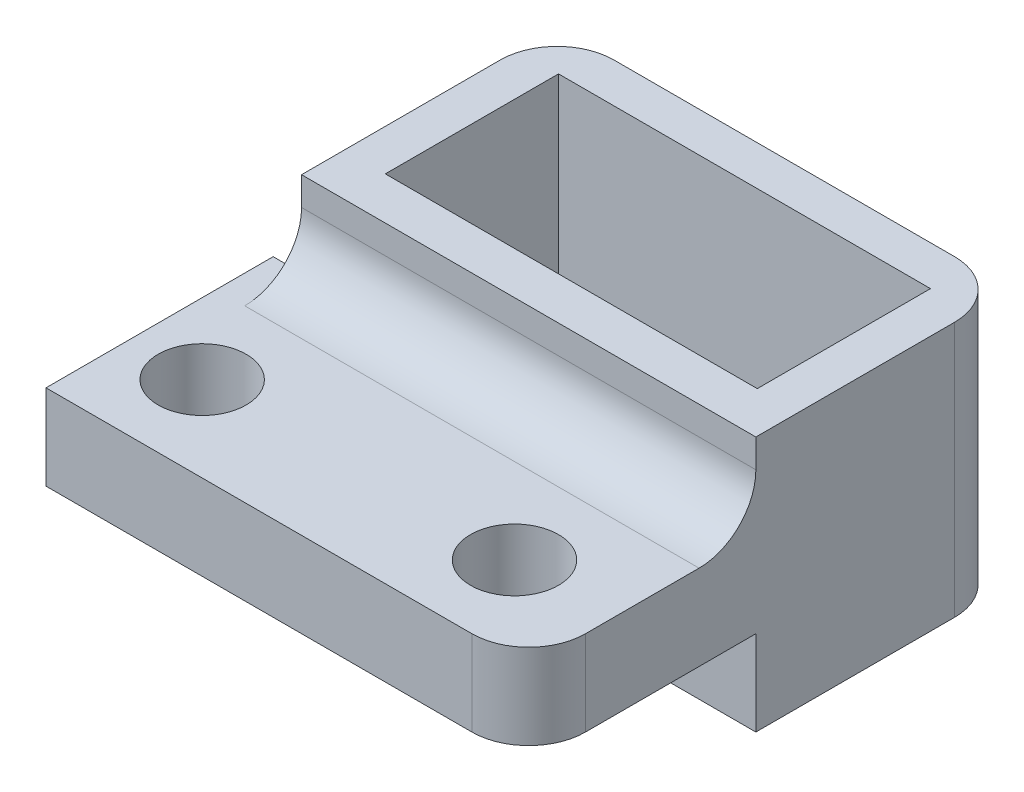
ISO-10303-21;
HEADER;
FILE_DESCRIPTION(('STEP AP214'),'2;1');
FILE_NAME('part.step','',(''),(''),'','','');
FILE_SCHEMA(('AUTOMOTIVE_DESIGN { 1 0 10303 214 1 1 1 1 }'));
ENDSEC;
DATA;
#1=APPLICATION_CONTEXT('core data for automotive mechanical design processes');
#2=APPLICATION_PROTOCOL_DEFINITION('international standard','automotive_design',2000,#1);
#3=PRODUCT_CONTEXT('',#1,'mechanical');
#4=PRODUCT('Part','Part','',(#3));
#5=PRODUCT_RELATED_PRODUCT_CATEGORY('part','',(#4));
#6=PRODUCT_DEFINITION_FORMATION('','',#4);
#7=PRODUCT_DEFINITION_CONTEXT('part definition',#1,'design');
#8=PRODUCT_DEFINITION('design','',#6,#7);
#9=PRODUCT_DEFINITION_SHAPE('','',#8);
#10=(LENGTH_UNIT() NAMED_UNIT(*) SI_UNIT(.MILLI.,.METRE.));
#11=(NAMED_UNIT(*) PLANE_ANGLE_UNIT() SI_UNIT($,.RADIAN.));
#12=(NAMED_UNIT(*) SI_UNIT($,.STERADIAN.) SOLID_ANGLE_UNIT());
#13=UNCERTAINTY_MEASURE_WITH_UNIT(LENGTH_MEASURE(1.E-05),#10,'distance_accuracy_value','');
#14=(GEOMETRIC_REPRESENTATION_CONTEXT(3) GLOBAL_UNCERTAINTY_ASSIGNED_CONTEXT((#13)) GLOBAL_UNIT_ASSIGNED_CONTEXT((#10,
#11,#12)) REPRESENTATION_CONTEXT('',''));
#15=CARTESIAN_POINT('',(0.,0.,0.));
#16=DIRECTION('',(0.,0.,1.));
#17=DIRECTION('',(1.,0.,0.));
#18=AXIS2_PLACEMENT_3D('',#15,#16,#17);
#19=CARTESIAN_POINT('',(0.,3.,0.));
#20=DIRECTION('',(0.,-1.,0.));
#21=DIRECTION('',(0.,0.,-1.));
#22=AXIS2_PLACEMENT_3D('',#19,#20,#21);
#23=PLANE('',#22);
#24=CARTESIAN_POINT('',(3.5,3.,-3.));
#25=DIRECTION('',(0.,1.,0.));
#26=DIRECTION('',(0.,0.,1.));
#27=AXIS2_PLACEMENT_3D('',#24,#25,#26);
#28=CIRCLE('',#27,1.55);
#29=CARTESIAN_POINT('',(3.5,3.,-1.45));
#30=VERTEX_POINT('',#29);
#31=EDGE_CURVE('E213',#30,#30,#28,.T.);
#32=ORIENTED_EDGE('',*,*,#31,.F.);
#33=EDGE_LOOP('',(#32));
#34=FACE_BOUND('',#33,.T.);
#35=CARTESIAN_POINT('',(14.5,3.,-3.));
#36=DIRECTION('',(0.,1.,0.));
#37=DIRECTION('',(0.,0.,1.));
#38=AXIS2_PLACEMENT_3D('',#35,#36,#37);
#39=CIRCLE('',#38,1.55);
#40=CARTESIAN_POINT('',(14.5,3.,-1.45));
#41=VERTEX_POINT('',#40);
#42=EDGE_CURVE('E275',#41,#41,#39,.T.);
#43=ORIENTED_EDGE('',*,*,#42,.F.);
#44=EDGE_LOOP('',(#43));
#45=FACE_BOUND('',#44,.T.);
#46=DIRECTION('',(0.,0.,-1.));
#47=VECTOR('',#46,1.);
#48=CARTESIAN_POINT('',(18.,3.,0.));
#49=LINE('',#48,#47);
#50=CARTESIAN_POINT('',(18.,3.,-2.));
#51=VERTEX_POINT('',#50);
#52=CARTESIAN_POINT('',(18.,3.,-6.));
#53=VERTEX_POINT('',#52);
#54=EDGE_CURVE('E202',#51,#53,#49,.T.);
#55=ORIENTED_EDGE('',*,*,#54,.T.);
#56=DIRECTION('',(1.,0.,0.));
#57=VECTOR('',#56,1.);
#58=CARTESIAN_POINT('',(2.,3.,-6.));
#59=LINE('',#58,#57);
#60=CARTESIAN_POINT('',(2.,3.,-6.));
#61=VERTEX_POINT('',#60);
#62=EDGE_CURVE('E245',#53,#61,#59,.F.);
#63=ORIENTED_EDGE('',*,*,#62,.T.);
#64=DIRECTION('',(0.,0.,-1.));
#65=VECTOR('',#64,1.);
#66=CARTESIAN_POINT('',(2.,3.,-18.));
#67=LINE('',#66,#65);
#68=CARTESIAN_POINT('',(2.,3.,-8.));
#69=VERTEX_POINT('',#68);
#70=EDGE_CURVE('E49',#61,#69,#67,.T.);
#71=ORIENTED_EDGE('',*,*,#70,.T.);
#72=DIRECTION('',(1.,0.,0.));
#73=VECTOR('',#72,1.);
#74=CARTESIAN_POINT('',(0.,3.,-8.));
#75=LINE('',#74,#73);
#76=CARTESIAN_POINT('',(1.,3.,-8.));
#77=VERTEX_POINT('',#76);
#78=EDGE_CURVE('E195',#77,#69,#75,.T.);
#79=ORIENTED_EDGE('',*,*,#78,.F.);
#80=DIRECTION('',(0.,0.,-1.));
#81=VECTOR('',#80,1.);
#82=CARTESIAN_POINT('',(1.,3.,0.));
#83=LINE('',#82,#81);
#84=CARTESIAN_POINT('',(1.,3.,0.));
#85=VERTEX_POINT('',#84);
#86=EDGE_CURVE('E182',#85,#77,#83,.T.);
#87=ORIENTED_EDGE('',*,*,#86,.F.);
#88=DIRECTION('',(1.,0.,0.));
#89=VECTOR('',#88,1.);
#90=CARTESIAN_POINT('',(0.,3.,0.));
#91=LINE('',#90,#89);
#92=CARTESIAN_POINT('',(16.,3.,0.));
#93=VERTEX_POINT('',#92);
#94=EDGE_CURVE('E192',#85,#93,#91,.T.);
#95=ORIENTED_EDGE('',*,*,#94,.T.);
#96=CARTESIAN_POINT('',(16.,3.,-2.));
#97=DIRECTION('',(0.,-1.,0.));
#98=DIRECTION('',(0.,0.,-1.));
#99=AXIS2_PLACEMENT_3D('',#96,#97,#98);
#100=CIRCLE('',#99,2.);
#101=EDGE_CURVE('E224',#93,#51,#100,.F.);
#102=ORIENTED_EDGE('',*,*,#101,.T.);
#103=EDGE_LOOP('',(#55,#63,#71,#79,#87,#95,#102));
#104=FACE_BOUND('',#103,.T.);
#105=ADVANCED_FACE('F35',(#34,#45,#104),#23,.F.);
#106=CARTESIAN_POINT('',(0.,0.,0.));
#107=DIRECTION('',(0.,-1.,0.));
#108=DIRECTION('',(0.,0.,-1.));
#109=AXIS2_PLACEMENT_3D('',#106,#107,#108);
#110=PLANE('',#109);
#111=CARTESIAN_POINT('',(3.5,0.,-3.));
#112=DIRECTION('',(0.,1.,0.));
#113=DIRECTION('',(0.,0.,1.));
#114=AXIS2_PLACEMENT_3D('',#111,#112,#113);
#115=CIRCLE('',#114,1.55);
#116=CARTESIAN_POINT('',(3.5,0.,-1.45));
#117=VERTEX_POINT('',#116);
#118=EDGE_CURVE('E210',#117,#117,#115,.T.);
#119=ORIENTED_EDGE('',*,*,#118,.T.);
#120=EDGE_LOOP('',(#119));
#121=FACE_BOUND('',#120,.T.);
#122=CARTESIAN_POINT('',(14.5,0.,-3.));
#123=DIRECTION('',(0.,1.,0.));
#124=DIRECTION('',(0.,0.,1.));
#125=AXIS2_PLACEMENT_3D('',#122,#123,#124);
#126=CIRCLE('',#125,1.55);
#127=CARTESIAN_POINT('',(14.5,0.,-1.45));
#128=VERTEX_POINT('',#127);
#129=EDGE_CURVE('E274',#128,#128,#126,.T.);
#130=ORIENTED_EDGE('',*,*,#129,.T.);
#131=EDGE_LOOP('',(#130));
#132=FACE_BOUND('',#131,.T.);
#133=DIRECTION('',(1.,0.,0.));
#134=VECTOR('',#133,1.);
#135=CARTESIAN_POINT('',(0.,0.,0.));
#136=LINE('',#135,#134);
#137=CARTESIAN_POINT('',(1.,0.,0.));
#138=VERTEX_POINT('',#137);
#139=CARTESIAN_POINT('',(16.,0.,0.));
#140=VERTEX_POINT('',#139);
#141=EDGE_CURVE('E207',#138,#140,#136,.T.);
#142=ORIENTED_EDGE('',*,*,#141,.F.);
#143=DIRECTION('',(0.,0.,1.));
#144=VECTOR('',#143,1.);
#145=CARTESIAN_POINT('',(1.,0.,-8.));
#146=LINE('',#145,#144);
#147=CARTESIAN_POINT('',(1.,0.,-8.));
#148=VERTEX_POINT('',#147);
#149=EDGE_CURVE('E185',#148,#138,#146,.T.);
#150=ORIENTED_EDGE('',*,*,#149,.F.);
#151=DIRECTION('',(-1.,0.,0.));
#152=VECTOR('',#151,1.);
#153=CARTESIAN_POINT('',(0.,0.,-8.));
#154=LINE('',#153,#152);
#155=CARTESIAN_POINT('',(2.,0.,-8.));
#156=VERTEX_POINT('',#155);
#157=EDGE_CURVE('E424',#156,#148,#154,.T.);
#158=ORIENTED_EDGE('',*,*,#157,.F.);
#159=DIRECTION('',(-1.,0.,0.));
#160=VECTOR('',#159,1.);
#161=CARTESIAN_POINT('',(18.,0.,-8.));
#162=LINE('',#161,#160);
#163=CARTESIAN_POINT('',(18.,0.,-8.));
#164=VERTEX_POINT('',#163);
#165=EDGE_CURVE('E391',#164,#156,#162,.T.);
#166=ORIENTED_EDGE('',*,*,#165,.F.);
#167=DIRECTION('',(0.,0.,-1.));
#168=VECTOR('',#167,1.);
#169=CARTESIAN_POINT('',(18.,0.,0.));
#170=LINE('',#169,#168);
#171=CARTESIAN_POINT('',(18.,0.,-2.));
#172=VERTEX_POINT('',#171);
#173=EDGE_CURVE('E203',#172,#164,#170,.T.);
#174=ORIENTED_EDGE('',*,*,#173,.F.);
#175=CARTESIAN_POINT('',(16.,0.,-2.));
#176=DIRECTION('',(0.,-1.,0.));
#177=DIRECTION('',(0.,0.,-1.));
#178=AXIS2_PLACEMENT_3D('',#175,#176,#177);
#179=CIRCLE('',#178,2.);
#180=EDGE_CURVE('E220',#172,#140,#179,.T.);
#181=ORIENTED_EDGE('',*,*,#180,.T.);
#182=EDGE_LOOP('',(#142,#150,#158,#166,#174,#181));
#183=FACE_BOUND('',#182,.T.);
#184=ADVANCED_FACE('F285',(#121,#132,#183),#110,.T.);
#185=CARTESIAN_POINT('',(0.,3.,0.));
#186=DIRECTION('',(0.,0.,-1.));
#187=DIRECTION('',(-1.,0.,0.));
#188=AXIS2_PLACEMENT_3D('',#185,#186,#187);
#189=PLANE('',#188);
#190=DIRECTION('',(0.,1.,0.));
#191=VECTOR('',#190,1.);
#192=CARTESIAN_POINT('',(1.,0.,0.));
#193=LINE('',#192,#191);
#194=EDGE_CURVE('E179',#138,#85,#193,.T.);
#195=ORIENTED_EDGE('',*,*,#194,.F.);
#196=ORIENTED_EDGE('',*,*,#141,.T.);
#197=DIRECTION('',(0.,-1.,0.));
#198=VECTOR('',#197,1.);
#199=CARTESIAN_POINT('',(16.,3.,0.));
#200=LINE('',#199,#198);
#201=EDGE_CURVE('E200',#140,#93,#200,.F.);
#202=ORIENTED_EDGE('',*,*,#201,.T.);
#203=ORIENTED_EDGE('',*,*,#94,.F.);
#204=EDGE_LOOP('',(#195,#196,#202,#203));
#205=FACE_BOUND('',#204,.T.);
#206=ADVANCED_FACE('F198',(#205),#189,.F.);
#207=CARTESIAN_POINT('',(0.,16.1980390271856,-8.));
#208=DIRECTION('',(0.,0.,1.));
#209=DIRECTION('',(1.,0.,0.));
#210=AXIS2_PLACEMENT_3D('',#207,#208,#209);
#211=PLANE('',#210);
#212=DIRECTION('',(0.,-1.,0.));
#213=VECTOR('',#212,1.);
#214=CARTESIAN_POINT('',(1.,3.,-8.));
#215=LINE('',#214,#213);
#216=EDGE_CURVE('E196',#77,#148,#215,.T.);
#217=ORIENTED_EDGE('',*,*,#216,.F.);
#218=ORIENTED_EDGE('',*,*,#78,.T.);
#219=DIRECTION('',(0.,-1.,0.));
#220=VECTOR('',#219,1.);
#221=CARTESIAN_POINT('',(2.,16.1980390271856,-8.));
#222=LINE('',#221,#220);
#223=EDGE_CURVE('E260',#69,#156,#222,.T.);
#224=ORIENTED_EDGE('',*,*,#223,.T.);
#225=ORIENTED_EDGE('',*,*,#157,.T.);
#226=EDGE_LOOP('',(#217,#218,#224,#225));
#227=FACE_BOUND('',#226,.T.);
#228=ADVANCED_FACE('F312',(#227),#211,.F.);
#229=CARTESIAN_POINT('',(3.45,-14.450605523645,-9.5));
#230=DIRECTION('',(0.,0.,1.));
#231=DIRECTION('',(1.,0.,0.));
#232=AXIS2_PLACEMENT_3D('',#229,#230,#231);
#233=PLANE('',#232);
#234=DIRECTION('',(-1.,0.,0.));
#235=VECTOR('',#234,1.);
#236=CARTESIAN_POINT('',(16.55,-0.5,-9.5));
#237=LINE('',#236,#235);
#238=CARTESIAN_POINT('',(16.55,-0.5,-9.5));
#239=VERTEX_POINT('',#238);
#240=CARTESIAN_POINT('',(3.45,-0.5,-9.5));
#241=VERTEX_POINT('',#240);
#242=EDGE_CURVE('E386',#239,#241,#237,.T.);
#243=ORIENTED_EDGE('',*,*,#242,.T.);
#244=DIRECTION('',(0.,1.,0.));
#245=VECTOR('',#244,1.);
#246=CARTESIAN_POINT('',(3.45,-14.450605523645,-9.5));
#247=LINE('',#246,#245);
#248=CARTESIAN_POINT('',(3.45,6.,-9.5));
#249=VERTEX_POINT('',#248);
#250=EDGE_CURVE('E420',#241,#249,#247,.T.);
#251=ORIENTED_EDGE('',*,*,#250,.T.);
#252=DIRECTION('',(1.,0.,0.));
#253=VECTOR('',#252,1.);
#254=CARTESIAN_POINT('',(3.45,6.,-9.5));
#255=LINE('',#254,#253);
#256=CARTESIAN_POINT('',(16.55,6.,-9.5));
#257=VERTEX_POINT('',#256);
#258=EDGE_CURVE('E413',#249,#257,#255,.T.);
#259=ORIENTED_EDGE('',*,*,#258,.T.);
#260=DIRECTION('',(0.,1.,0.));
#261=VECTOR('',#260,1.);
#262=CARTESIAN_POINT('',(16.55,-14.450605523645,-9.5));
#263=LINE('',#262,#261);
#264=EDGE_CURVE('E409',#239,#257,#263,.T.);
#265=ORIENTED_EDGE('',*,*,#264,.F.);
#266=EDGE_LOOP('',(#243,#251,#259,#265));
#267=FACE_BOUND('',#266,.T.);
#268=ADVANCED_FACE('F440',(#267),#233,.F.);
#269=CARTESIAN_POINT('',(16.55,-14.450605523645,-15.6));
#270=DIRECTION('',(1.,0.,0.));
#271=DIRECTION('',(0.,0.,-1.));
#272=AXIS2_PLACEMENT_3D('',#269,#270,#271);
#273=PLANE('',#272);
#274=DIRECTION('',(0.,0.,1.));
#275=VECTOR('',#274,1.);
#276=CARTESIAN_POINT('',(16.55,-0.5,-15.6));
#277=LINE('',#276,#275);
#278=CARTESIAN_POINT('',(16.55,-0.5,-15.6));
#279=VERTEX_POINT('',#278);
#280=EDGE_CURVE('E384',#279,#239,#277,.T.);
#281=ORIENTED_EDGE('',*,*,#280,.T.);
#282=ORIENTED_EDGE('',*,*,#264,.T.);
#283=DIRECTION('',(0.,0.,-1.));
#284=VECTOR('',#283,1.);
#285=CARTESIAN_POINT('',(16.55,6.,-15.6));
#286=LINE('',#285,#284);
#287=CARTESIAN_POINT('',(16.55,6.,-15.6));
#288=VERTEX_POINT('',#287);
#289=EDGE_CURVE('E410',#257,#288,#286,.T.);
#290=ORIENTED_EDGE('',*,*,#289,.T.);
#291=DIRECTION('',(0.,1.,0.));
#292=VECTOR('',#291,1.);
#293=CARTESIAN_POINT('',(16.55,-14.450605523645,-15.6));
#294=LINE('',#293,#292);
#295=EDGE_CURVE('E421',#279,#288,#294,.T.);
#296=ORIENTED_EDGE('',*,*,#295,.F.);
#297=EDGE_LOOP('',(#281,#282,#290,#296));
#298=FACE_BOUND('',#297,.T.);
#299=ADVANCED_FACE('F445',(#298),#273,.F.);
#300=CARTESIAN_POINT('',(3.45,-14.450605523645,-15.6));
#301=DIRECTION('',(0.,0.,-1.));
#302=DIRECTION('',(-1.,0.,0.));
#303=AXIS2_PLACEMENT_3D('',#300,#301,#302);
#304=PLANE('',#303);
#305=DIRECTION('',(1.,0.,0.));
#306=VECTOR('',#305,1.);
#307=CARTESIAN_POINT('',(3.45,-0.5,-15.6));
#308=LINE('',#307,#306);
#309=CARTESIAN_POINT('',(3.45,-0.5,-15.6));
#310=VERTEX_POINT('',#309);
#311=EDGE_CURVE('E376',#310,#279,#308,.T.);
#312=ORIENTED_EDGE('',*,*,#311,.T.);
#313=ORIENTED_EDGE('',*,*,#295,.T.);
#314=DIRECTION('',(-1.,0.,0.));
#315=VECTOR('',#314,1.);
#316=CARTESIAN_POINT('',(3.45,6.,-15.6));
#317=LINE('',#316,#315);
#318=CARTESIAN_POINT('',(3.45,6.,-15.6));
#319=VERTEX_POINT('',#318);
#320=EDGE_CURVE('E406',#288,#319,#317,.T.);
#321=ORIENTED_EDGE('',*,*,#320,.T.);
#322=DIRECTION('',(0.,1.,0.));
#323=VECTOR('',#322,1.);
#324=CARTESIAN_POINT('',(3.45,-14.450605523645,-15.6));
#325=LINE('',#324,#323);
#326=EDGE_CURVE('E418',#310,#319,#325,.T.);
#327=ORIENTED_EDGE('',*,*,#326,.F.);
#328=EDGE_LOOP('',(#312,#313,#321,#327));
#329=FACE_BOUND('',#328,.T.);
#330=ADVANCED_FACE('F583',(#329),#304,.F.);
#331=CARTESIAN_POINT('',(3.45,-14.450605523645,-15.6));
#332=DIRECTION('',(-1.,0.,0.));
#333=DIRECTION('',(0.,0.,1.));
#334=AXIS2_PLACEMENT_3D('',#331,#332,#333);
#335=PLANE('',#334);
#336=DIRECTION('',(0.,0.,-1.));
#337=VECTOR('',#336,1.);
#338=CARTESIAN_POINT('',(3.45,-0.5,-9.5));
#339=LINE('',#338,#337);
#340=EDGE_CURVE('E389',#241,#310,#339,.T.);
#341=ORIENTED_EDGE('',*,*,#340,.T.);
#342=ORIENTED_EDGE('',*,*,#326,.T.);
#343=DIRECTION('',(0.,0.,1.));
#344=VECTOR('',#343,1.);
#345=CARTESIAN_POINT('',(3.45,6.,-15.6));
#346=LINE('',#345,#344);
#347=EDGE_CURVE('E405',#319,#249,#346,.T.);
#348=ORIENTED_EDGE('',*,*,#347,.T.);
#349=ORIENTED_EDGE('',*,*,#250,.F.);
#350=EDGE_LOOP('',(#341,#342,#348,#349));
#351=FACE_BOUND('',#350,.T.);
#352=ADVANCED_FACE('F299',(#351),#335,.F.);
#353=CARTESIAN_POINT('',(18.,3.,0.));
#354=DIRECTION('',(-1.,0.,0.));
#355=DIRECTION('',(0.,0.,1.));
#356=AXIS2_PLACEMENT_3D('',#353,#354,#355);
#357=PLANE('',#356);
#358=ORIENTED_EDGE('',*,*,#54,.F.);
#359=DIRECTION('',(0.,-1.,0.));
#360=VECTOR('',#359,1.);
#361=CARTESIAN_POINT('',(18.,3.,-2.));
#362=LINE('',#361,#360);
#363=EDGE_CURVE('E217',#51,#172,#362,.T.);
#364=ORIENTED_EDGE('',*,*,#363,.T.);
#365=ORIENTED_EDGE('',*,*,#173,.T.);
#366=DIRECTION('',(0.,1.,0.));
#367=VECTOR('',#366,1.);
#368=CARTESIAN_POINT('',(18.,-3.,-8.));
#369=LINE('',#368,#367);
#370=CARTESIAN_POINT('',(18.,-3.,-8.));
#371=VERTEX_POINT('',#370);
#372=EDGE_CURVE('E402',#371,#164,#369,.T.);
#373=ORIENTED_EDGE('',*,*,#372,.F.);
#374=DIRECTION('',(0.,0.,1.));
#375=VECTOR('',#374,1.);
#376=CARTESIAN_POINT('',(18.,-3.,-18.));
#377=LINE('',#376,#375);
#378=CARTESIAN_POINT('',(18.,-3.,-15.));
#379=VERTEX_POINT('',#378);
#380=EDGE_CURVE('E392',#379,#371,#377,.T.);
#381=ORIENTED_EDGE('',*,*,#380,.F.);
#382=DIRECTION('',(0.,1.,0.));
#383=VECTOR('',#382,1.);
#384=CARTESIAN_POINT('',(18.,3.,-15.));
#385=LINE('',#384,#383);
#386=CARTESIAN_POINT('',(18.,6.,-15.));
#387=VERTEX_POINT('',#386);
#388=EDGE_CURVE('E205',#379,#387,#385,.T.);
#389=ORIENTED_EDGE('',*,*,#388,.T.);
#390=DIRECTION('',(0.,0.,-1.));
#391=VECTOR('',#390,1.);
#392=CARTESIAN_POINT('',(18.,6.,-18.));
#393=LINE('',#392,#391);
#394=CARTESIAN_POINT('',(18.,6.,-8.));
#395=VERTEX_POINT('',#394);
#396=EDGE_CURVE('E269',#395,#387,#393,.T.);
#397=ORIENTED_EDGE('',*,*,#396,.F.);
#398=DIRECTION('',(0.,-1.,0.));
#399=VECTOR('',#398,1.);
#400=CARTESIAN_POINT('',(18.,6.,-8.));
#401=LINE('',#400,#399);
#402=CARTESIAN_POINT('',(18.,5.,-8.));
#403=VERTEX_POINT('',#402);
#404=EDGE_CURVE('E271',#395,#403,#401,.T.);
#405=ORIENTED_EDGE('',*,*,#404,.T.);
#406=CARTESIAN_POINT('',(18.,5.,-6.));
#407=DIRECTION('',(-1.,0.,0.));
#408=DIRECTION('',(0.,0.,1.));
#409=AXIS2_PLACEMENT_3D('',#406,#407,#408);
#410=CIRCLE('',#409,2.);
#411=EDGE_CURVE('E43',#403,#53,#410,.T.);
#412=ORIENTED_EDGE('',*,*,#411,.T.);
#413=EDGE_LOOP('',(#358,#364,#365,#373,#381,#389,#397,#405,#412));
#414=FACE_BOUND('',#413,.T.);
#415=ADVANCED_FACE('F291',(#414),#357,.F.);
#416=CARTESIAN_POINT('',(3.5,3.,-3.));
#417=DIRECTION('',(0.,-1.,0.));
#418=DIRECTION('',(0.,0.,-1.));
#419=AXIS2_PLACEMENT_3D('',#416,#417,#418);
#420=CYLINDRICAL_SURFACE('',#419,1.55);
#421=ORIENTED_EDGE('',*,*,#31,.T.);
#422=EDGE_LOOP('',(#421));
#423=FACE_BOUND('',#422,.T.);
#424=ORIENTED_EDGE('',*,*,#118,.F.);
#425=EDGE_LOOP('',(#424));
#426=FACE_BOUND('',#425,.T.);
#427=ADVANCED_FACE('F288',(#423,#426),#420,.F.);
#428=CARTESIAN_POINT('',(14.5,3.,-3.));
#429=DIRECTION('',(0.,-1.,0.));
#430=DIRECTION('',(0.,0.,-1.));
#431=AXIS2_PLACEMENT_3D('',#428,#429,#430);
#432=CYLINDRICAL_SURFACE('',#431,1.55);
#433=ORIENTED_EDGE('',*,*,#42,.T.);
#434=EDGE_LOOP('',(#433));
#435=FACE_BOUND('',#434,.T.);
#436=ORIENTED_EDGE('',*,*,#129,.F.);
#437=EDGE_LOOP('',(#436));
#438=FACE_BOUND('',#437,.T.);
#439=ADVANCED_FACE('F290',(#435,#438),#432,.F.);
#440=CARTESIAN_POINT('',(0.,6.,-8.));
#441=DIRECTION('',(0.,0.,-1.));
#442=DIRECTION('',(-1.,0.,0.));
#443=AXIS2_PLACEMENT_3D('',#440,#441,#442);
#444=PLANE('',#443);
#445=CARTESIAN_POINT('',(2.,6.,-8.));
#446=VERTEX_POINT('',#445);
#447=CARTESIAN_POINT('',(2.,5.,-8.));
#448=VERTEX_POINT('',#447);
#449=EDGE_CURVE('E254',#446,#448,#222,.T.);
#450=ORIENTED_EDGE('',*,*,#449,.T.);
#451=DIRECTION('',(1.,0.,0.));
#452=VECTOR('',#451,1.);
#453=CARTESIAN_POINT('',(18.,5.,-8.));
#454=LINE('',#453,#452);
#455=EDGE_CURVE('E241',#448,#403,#454,.T.);
#456=ORIENTED_EDGE('',*,*,#455,.T.);
#457=ORIENTED_EDGE('',*,*,#404,.F.);
#458=DIRECTION('',(1.,0.,0.));
#459=VECTOR('',#458,1.);
#460=CARTESIAN_POINT('',(0.,6.,-8.));
#461=LINE('',#460,#459);
#462=EDGE_CURVE('E259',#446,#395,#461,.T.);
#463=ORIENTED_EDGE('',*,*,#462,.F.);
#464=EDGE_LOOP('',(#450,#456,#457,#463));
#465=FACE_BOUND('',#464,.T.);
#466=ADVANCED_FACE('F257',(#465),#444,.F.);
#467=CARTESIAN_POINT('',(0.,6.,0.));
#468=DIRECTION('',(0.,1.,0.));
#469=DIRECTION('',(0.,0.,1.));
#470=AXIS2_PLACEMENT_3D('',#467,#468,#469);
#471=PLANE('',#470);
#472=ORIENTED_EDGE('',*,*,#396,.T.);
#473=CARTESIAN_POINT('',(16.,6.,-15.));
#474=DIRECTION('',(0.,1.,0.));
#475=DIRECTION('',(0.,0.,1.));
#476=AXIS2_PLACEMENT_3D('',#473,#474,#475);
#477=CIRCLE('',#476,2.);
#478=CARTESIAN_POINT('',(16.,6.,-17.));
#479=VERTEX_POINT('',#478);
#480=EDGE_CURVE('E228',#387,#479,#477,.T.);
#481=ORIENTED_EDGE('',*,*,#480,.T.);
#482=DIRECTION('',(1.,0.,0.));
#483=VECTOR('',#482,1.);
#484=CARTESIAN_POINT('',(2.,6.,-17.));
#485=LINE('',#484,#483);
#486=CARTESIAN_POINT('',(4.,6.,-17.));
#487=VERTEX_POINT('',#486);
#488=EDGE_CURVE('E346',#487,#479,#485,.T.);
#489=ORIENTED_EDGE('',*,*,#488,.F.);
#490=CARTESIAN_POINT('',(4.,6.,-15.));
#491=DIRECTION('',(0.,1.,0.));
#492=DIRECTION('',(0.,0.,1.));
#493=AXIS2_PLACEMENT_3D('',#490,#491,#492);
#494=CIRCLE('',#493,2.);
#495=CARTESIAN_POINT('',(2.,6.,-15.));
#496=VERTEX_POINT('',#495);
#497=EDGE_CURVE('E226',#487,#496,#494,.T.);
#498=ORIENTED_EDGE('',*,*,#497,.T.);
#499=DIRECTION('',(0.,0.,1.));
#500=VECTOR('',#499,1.);
#501=CARTESIAN_POINT('',(2.,6.,-18.));
#502=LINE('',#501,#500);
#503=EDGE_CURVE('E264',#496,#446,#502,.T.);
#504=ORIENTED_EDGE('',*,*,#503,.T.);
#505=ORIENTED_EDGE('',*,*,#462,.T.);
#506=EDGE_LOOP('',(#472,#481,#489,#498,#504,#505));
#507=FACE_BOUND('',#506,.T.);
#508=ORIENTED_EDGE('',*,*,#258,.F.);
#509=ORIENTED_EDGE('',*,*,#347,.F.);
#510=ORIENTED_EDGE('',*,*,#320,.F.);
#511=ORIENTED_EDGE('',*,*,#289,.F.);
#512=EDGE_LOOP('',(#508,#509,#510,#511));
#513=FACE_BOUND('',#512,.T.);
#514=ADVANCED_FACE('F428',(#507,#513),#471,.T.);
#515=CARTESIAN_POINT('',(2.,16.1980390271856,-18.));
#516=DIRECTION('',(1.,0.,0.));
#517=DIRECTION('',(0.,0.,-1.));
#518=AXIS2_PLACEMENT_3D('',#515,#516,#517);
#519=PLANE('',#518);
#520=ORIENTED_EDGE('',*,*,#503,.F.);
#521=DIRECTION('',(0.,1.,0.));
#522=VECTOR('',#521,1.);
#523=CARTESIAN_POINT('',(2.,16.1980390271856,-15.));
#524=LINE('',#523,#522);
#525=CARTESIAN_POINT('',(2.,-3.,-15.));
#526=VERTEX_POINT('',#525);
#527=EDGE_CURVE('E239',#496,#526,#524,.F.);
#528=ORIENTED_EDGE('',*,*,#527,.T.);
#529=DIRECTION('',(0.,0.,-1.));
#530=VECTOR('',#529,1.);
#531=CARTESIAN_POINT('',(2.,-3.,-18.));
#532=LINE('',#531,#530);
#533=CARTESIAN_POINT('',(2.,-3.,-8.));
#534=VERTEX_POINT('',#533);
#535=EDGE_CURVE('E340',#534,#526,#532,.T.);
#536=ORIENTED_EDGE('',*,*,#535,.F.);
#537=DIRECTION('',(0.,1.,0.));
#538=VECTOR('',#537,1.);
#539=CARTESIAN_POINT('',(2.,-3.,-8.));
#540=LINE('',#539,#538);
#541=EDGE_CURVE('E397',#534,#156,#540,.T.);
#542=ORIENTED_EDGE('',*,*,#541,.T.);
#543=ORIENTED_EDGE('',*,*,#223,.F.);
#544=ORIENTED_EDGE('',*,*,#70,.F.);
#545=CARTESIAN_POINT('',(2.,5.,-6.));
#546=DIRECTION('',(1.,0.,0.));
#547=DIRECTION('',(0.,0.,-1.));
#548=AXIS2_PLACEMENT_3D('',#545,#546,#547);
#549=CIRCLE('',#548,2.);
#550=EDGE_CURVE('E11',#61,#448,#549,.T.);
#551=ORIENTED_EDGE('',*,*,#550,.T.);
#552=ORIENTED_EDGE('',*,*,#449,.F.);
#553=EDGE_LOOP('',(#520,#528,#536,#542,#543,#544,#551,#552));
#554=FACE_BOUND('',#553,.T.);
#555=ADVANCED_FACE('F253',(#554),#519,.F.);
#556=CARTESIAN_POINT('',(0.,-3.,0.));
#557=DIRECTION('',(0.,-1.,0.));
#558=DIRECTION('',(0.,0.,-1.));
#559=AXIS2_PLACEMENT_3D('',#556,#557,#558);
#560=PLANE('',#559);
#561=DIRECTION('',(1.,0.,0.));
#562=VECTOR('',#561,1.);
#563=CARTESIAN_POINT('',(2.,-3.,-17.));
#564=LINE('',#563,#562);
#565=CARTESIAN_POINT('',(4.,-3.,-17.));
#566=VERTEX_POINT('',#565);
#567=CARTESIAN_POINT('',(16.,-3.,-17.));
#568=VERTEX_POINT('',#567);
#569=EDGE_CURVE('E337',#566,#568,#564,.T.);
#570=ORIENTED_EDGE('',*,*,#569,.T.);
#571=CARTESIAN_POINT('',(16.,-3.,-15.));
#572=DIRECTION('',(0.,-1.,0.));
#573=DIRECTION('',(0.,0.,-1.));
#574=AXIS2_PLACEMENT_3D('',#571,#572,#573);
#575=CIRCLE('',#574,2.);
#576=EDGE_CURVE('E237',#568,#379,#575,.T.);
#577=ORIENTED_EDGE('',*,*,#576,.T.);
#578=ORIENTED_EDGE('',*,*,#380,.T.);
#579=DIRECTION('',(-1.,0.,0.));
#580=VECTOR('',#579,1.);
#581=CARTESIAN_POINT('',(18.,-3.,-8.));
#582=LINE('',#581,#580);
#583=EDGE_CURVE('E394',#371,#534,#582,.T.);
#584=ORIENTED_EDGE('',*,*,#583,.T.);
#585=ORIENTED_EDGE('',*,*,#535,.T.);
#586=CARTESIAN_POINT('',(4.,-3.,-15.));
#587=DIRECTION('',(0.,-1.,0.));
#588=DIRECTION('',(0.,0.,-1.));
#589=AXIS2_PLACEMENT_3D('',#586,#587,#588);
#590=CIRCLE('',#589,2.);
#591=EDGE_CURVE('E235',#526,#566,#590,.T.);
#592=ORIENTED_EDGE('',*,*,#591,.T.);
#593=EDGE_LOOP('',(#570,#577,#578,#584,#585,#592));
#594=FACE_BOUND('',#593,.T.);
#595=DIRECTION('',(1.,0.,0.));
#596=VECTOR('',#595,1.);
#597=CARTESIAN_POINT('',(4.2,-3.,-14.85));
#598=LINE('',#597,#596);
#599=CARTESIAN_POINT('',(4.2,-3.,-14.85));
#600=VERTEX_POINT('',#599);
#601=CARTESIAN_POINT('',(15.8,-3.,-14.85));
#602=VERTEX_POINT('',#601);
#603=EDGE_CURVE('E345',#600,#602,#598,.T.);
#604=ORIENTED_EDGE('',*,*,#603,.F.);
#605=DIRECTION('',(0.,0.,-1.));
#606=VECTOR('',#605,1.);
#607=CARTESIAN_POINT('',(4.2,-3.,-10.25));
#608=LINE('',#607,#606);
#609=CARTESIAN_POINT('',(4.2,-3.,-10.25));
#610=VERTEX_POINT('',#609);
#611=EDGE_CURVE('E357',#610,#600,#608,.T.);
#612=ORIENTED_EDGE('',*,*,#611,.F.);
#613=DIRECTION('',(-1.,0.,0.));
#614=VECTOR('',#613,1.);
#615=CARTESIAN_POINT('',(15.8,-3.,-10.25));
#616=LINE('',#615,#614);
#617=CARTESIAN_POINT('',(15.8,-3.,-10.25));
#618=VERTEX_POINT('',#617);
#619=EDGE_CURVE('E369',#618,#610,#616,.T.);
#620=ORIENTED_EDGE('',*,*,#619,.F.);
#621=DIRECTION('',(0.,0.,1.));
#622=VECTOR('',#621,1.);
#623=CARTESIAN_POINT('',(15.8,-3.,-14.85));
#624=LINE('',#623,#622);
#625=EDGE_CURVE('E348',#602,#618,#624,.T.);
#626=ORIENTED_EDGE('',*,*,#625,.F.);
#627=EDGE_LOOP('',(#604,#612,#620,#626));
#628=FACE_BOUND('',#627,.T.);
#629=ADVANCED_FACE('F335',(#594,#628),#560,.T.);
#630=CARTESIAN_POINT('',(18.,-3.,-8.));
#631=DIRECTION('',(0.,0.,-1.));
#632=DIRECTION('',(-1.,0.,0.));
#633=AXIS2_PLACEMENT_3D('',#630,#631,#632);
#634=PLANE('',#633);
#635=ORIENTED_EDGE('',*,*,#165,.T.);
#636=ORIENTED_EDGE('',*,*,#541,.F.);
#637=ORIENTED_EDGE('',*,*,#583,.F.);
#638=ORIENTED_EDGE('',*,*,#372,.T.);
#639=EDGE_LOOP('',(#635,#636,#637,#638));
#640=FACE_BOUND('',#639,.T.);
#641=ADVANCED_FACE('F433',(#640),#634,.F.);
#642=CARTESIAN_POINT('',(0.,-0.5,0.));
#643=DIRECTION('',(0.,-1.,0.));
#644=DIRECTION('',(0.,0.,-1.));
#645=AXIS2_PLACEMENT_3D('',#642,#643,#644);
#646=PLANE('',#645);
#647=DIRECTION('',(0.,0.,-1.));
#648=VECTOR('',#647,1.);
#649=CARTESIAN_POINT('',(4.2,-0.5,-10.25));
#650=LINE('',#649,#648);
#651=CARTESIAN_POINT('',(4.2,-0.5,-10.25));
#652=VERTEX_POINT('',#651);
#653=CARTESIAN_POINT('',(4.2,-0.5,-14.85));
#654=VERTEX_POINT('',#653);
#655=EDGE_CURVE('E363',#652,#654,#650,.T.);
#656=ORIENTED_EDGE('',*,*,#655,.T.);
#657=DIRECTION('',(1.,0.,0.));
#658=VECTOR('',#657,1.);
#659=CARTESIAN_POINT('',(4.2,-0.5,-14.85));
#660=LINE('',#659,#658);
#661=CARTESIAN_POINT('',(15.8,-0.5,-14.85));
#662=VERTEX_POINT('',#661);
#663=EDGE_CURVE('E353',#654,#662,#660,.T.);
#664=ORIENTED_EDGE('',*,*,#663,.T.);
#665=DIRECTION('',(0.,0.,1.));
#666=VECTOR('',#665,1.);
#667=CARTESIAN_POINT('',(15.8,-0.5,-14.85));
#668=LINE('',#667,#666);
#669=CARTESIAN_POINT('',(15.8,-0.5,-10.25));
#670=VERTEX_POINT('',#669);
#671=EDGE_CURVE('E356',#662,#670,#668,.T.);
#672=ORIENTED_EDGE('',*,*,#671,.T.);
#673=DIRECTION('',(-1.,0.,0.));
#674=VECTOR('',#673,1.);
#675=CARTESIAN_POINT('',(15.8,-0.5,-10.25));
#676=LINE('',#675,#674);
#677=EDGE_CURVE('E360',#670,#652,#676,.T.);
#678=ORIENTED_EDGE('',*,*,#677,.T.);
#679=EDGE_LOOP('',(#656,#664,#672,#678));
#680=FACE_BOUND('',#679,.T.);
#681=ORIENTED_EDGE('',*,*,#311,.F.);
#682=ORIENTED_EDGE('',*,*,#340,.F.);
#683=ORIENTED_EDGE('',*,*,#242,.F.);
#684=ORIENTED_EDGE('',*,*,#280,.F.);
#685=EDGE_LOOP('',(#681,#682,#683,#684));
#686=FACE_BOUND('',#685,.T.);
#687=ADVANCED_FACE('F483',(#680,#686),#646,.F.);
#688=CARTESIAN_POINT('',(4.2,-0.5,-14.85));
#689=DIRECTION('',(0.,0.,-1.));
#690=DIRECTION('',(-1.,0.,0.));
#691=AXIS2_PLACEMENT_3D('',#688,#689,#690);
#692=PLANE('',#691);
#693=ORIENTED_EDGE('',*,*,#603,.T.);
#694=DIRECTION('',(0.,-1.,0.));
#695=VECTOR('',#694,1.);
#696=CARTESIAN_POINT('',(15.8,-0.5,-14.85));
#697=LINE('',#696,#695);
#698=EDGE_CURVE('E365',#662,#602,#697,.T.);
#699=ORIENTED_EDGE('',*,*,#698,.F.);
#700=ORIENTED_EDGE('',*,*,#663,.F.);
#701=DIRECTION('',(0.,-1.,0.));
#702=VECTOR('',#701,1.);
#703=CARTESIAN_POINT('',(4.2,-0.5,-14.85));
#704=LINE('',#703,#702);
#705=EDGE_CURVE('E374',#654,#600,#704,.T.);
#706=ORIENTED_EDGE('',*,*,#705,.T.);
#707=EDGE_LOOP('',(#693,#699,#700,#706));
#708=FACE_BOUND('',#707,.T.);
#709=ADVANCED_FACE('F491',(#708),#692,.F.);
#710=CARTESIAN_POINT('',(4.2,-0.5,-10.25));
#711=DIRECTION('',(-1.,0.,0.));
#712=DIRECTION('',(0.,0.,1.));
#713=AXIS2_PLACEMENT_3D('',#710,#711,#712);
#714=PLANE('',#713);
#715=ORIENTED_EDGE('',*,*,#611,.T.);
#716=ORIENTED_EDGE('',*,*,#705,.F.);
#717=ORIENTED_EDGE('',*,*,#655,.F.);
#718=DIRECTION('',(0.,-1.,0.));
#719=VECTOR('',#718,1.);
#720=CARTESIAN_POINT('',(4.2,-0.5,-10.25));
#721=LINE('',#720,#719);
#722=EDGE_CURVE('E377',#652,#610,#721,.T.);
#723=ORIENTED_EDGE('',*,*,#722,.T.);
#724=EDGE_LOOP('',(#715,#716,#717,#723));
#725=FACE_BOUND('',#724,.T.);
#726=ADVANCED_FACE('F500',(#725),#714,.F.);
#727=CARTESIAN_POINT('',(15.8,-0.5,-10.25));
#728=DIRECTION('',(0.,0.,1.));
#729=DIRECTION('',(1.,0.,0.));
#730=AXIS2_PLACEMENT_3D('',#727,#728,#729);
#731=PLANE('',#730);
#732=ORIENTED_EDGE('',*,*,#619,.T.);
#733=ORIENTED_EDGE('',*,*,#722,.F.);
#734=ORIENTED_EDGE('',*,*,#677,.F.);
#735=DIRECTION('',(0.,-1.,0.));
#736=VECTOR('',#735,1.);
#737=CARTESIAN_POINT('',(15.8,-0.5,-10.25));
#738=LINE('',#737,#736);
#739=EDGE_CURVE('E379',#670,#618,#738,.T.);
#740=ORIENTED_EDGE('',*,*,#739,.T.);
#741=EDGE_LOOP('',(#732,#733,#734,#740));
#742=FACE_BOUND('',#741,.T.);
#743=ADVANCED_FACE('F508',(#742),#731,.F.);
#744=CARTESIAN_POINT('',(15.8,-0.5,-14.85));
#745=DIRECTION('',(1.,0.,0.));
#746=DIRECTION('',(0.,0.,-1.));
#747=AXIS2_PLACEMENT_3D('',#744,#745,#746);
#748=PLANE('',#747);
#749=ORIENTED_EDGE('',*,*,#625,.T.);
#750=ORIENTED_EDGE('',*,*,#739,.F.);
#751=ORIENTED_EDGE('',*,*,#671,.F.);
#752=ORIENTED_EDGE('',*,*,#698,.T.);
#753=EDGE_LOOP('',(#749,#750,#751,#752));
#754=FACE_BOUND('',#753,.T.);
#755=ADVANCED_FACE('F516',(#754),#748,.F.);
#756=CARTESIAN_POINT('',(2.,-19.0312195418814,-17.));
#757=DIRECTION('',(0.,0.,1.));
#758=DIRECTION('',(1.,0.,0.));
#759=AXIS2_PLACEMENT_3D('',#756,#757,#758);
#760=PLANE('',#759);
#761=ORIENTED_EDGE('',*,*,#488,.T.);
#762=DIRECTION('',(0.,1.,0.));
#763=VECTOR('',#762,1.);
#764=CARTESIAN_POINT('',(16.,-19.0312195418814,-17.));
#765=LINE('',#764,#763);
#766=EDGE_CURVE('E233',#479,#568,#765,.F.);
#767=ORIENTED_EDGE('',*,*,#766,.T.);
#768=ORIENTED_EDGE('',*,*,#569,.F.);
#769=DIRECTION('',(0.,1.,0.));
#770=VECTOR('',#769,1.);
#771=CARTESIAN_POINT('',(4.,-19.0312195418814,-17.));
#772=LINE('',#771,#770);
#773=EDGE_CURVE('E230',#566,#487,#772,.T.);
#774=ORIENTED_EDGE('',*,*,#773,.T.);
#775=EDGE_LOOP('',(#761,#767,#768,#774));
#776=FACE_BOUND('',#775,.T.);
#777=ADVANCED_FACE('F317',(#776),#760,.F.);
#778=CARTESIAN_POINT('',(16.,3.,-2.));
#779=DIRECTION('',(0.,-1.,0.));
#780=DIRECTION('',(0.,0.,-1.));
#781=AXIS2_PLACEMENT_3D('',#778,#779,#780);
#782=CYLINDRICAL_SURFACE('',#781,2.);
#783=ORIENTED_EDGE('',*,*,#101,.F.);
#784=ORIENTED_EDGE('',*,*,#201,.F.);
#785=ORIENTED_EDGE('',*,*,#180,.F.);
#786=ORIENTED_EDGE('',*,*,#363,.F.);
#787=EDGE_LOOP('',(#783,#784,#785,#786));
#788=FACE_BOUND('',#787,.T.);
#789=ADVANCED_FACE('F313',(#788),#782,.T.);
#790=CARTESIAN_POINT('',(16.,3.,-15.));
#791=DIRECTION('',(0.,1.,0.));
#792=DIRECTION('',(0.,0.,1.));
#793=AXIS2_PLACEMENT_3D('',#790,#791,#792);
#794=CYLINDRICAL_SURFACE('',#793,2.);
#795=ORIENTED_EDGE('',*,*,#576,.F.);
#796=ORIENTED_EDGE('',*,*,#766,.F.);
#797=ORIENTED_EDGE('',*,*,#480,.F.);
#798=ORIENTED_EDGE('',*,*,#388,.F.);
#799=EDGE_LOOP('',(#795,#796,#797,#798));
#800=FACE_BOUND('',#799,.T.);
#801=ADVANCED_FACE('F316',(#800),#794,.T.);
#802=CARTESIAN_POINT('',(4.,-19.0312195418814,-15.));
#803=DIRECTION('',(0.,1.,0.));
#804=DIRECTION('',(0.,0.,1.));
#805=AXIS2_PLACEMENT_3D('',#802,#803,#804);
#806=CYLINDRICAL_SURFACE('',#805,2.);
#807=ORIENTED_EDGE('',*,*,#591,.F.);
#808=ORIENTED_EDGE('',*,*,#527,.F.);
#809=ORIENTED_EDGE('',*,*,#497,.F.);
#810=ORIENTED_EDGE('',*,*,#773,.F.);
#811=EDGE_LOOP('',(#807,#808,#809,#810));
#812=FACE_BOUND('',#811,.T.);
#813=ADVANCED_FACE('F320',(#812),#806,.T.);
#814=CARTESIAN_POINT('',(1.,0.,0.));
#815=DIRECTION('',(-1.,0.,0.));
#816=DIRECTION('',(0.,0.,1.));
#817=AXIS2_PLACEMENT_3D('',#814,#815,#816);
#818=PLANE('',#817);
#819=ORIENTED_EDGE('',*,*,#194,.T.);
#820=ORIENTED_EDGE('',*,*,#86,.T.);
#821=ORIENTED_EDGE('',*,*,#216,.T.);
#822=ORIENTED_EDGE('',*,*,#149,.T.);
#823=EDGE_LOOP('',(#819,#820,#821,#822));
#824=FACE_BOUND('',#823,.T.);
#825=ADVANCED_FACE('F181',(#824),#818,.T.);
#826=CARTESIAN_POINT('',(0.,5.,-6.));
#827=DIRECTION('',(-1.,0.,0.));
#828=DIRECTION('',(0.,0.,1.));
#829=AXIS2_PLACEMENT_3D('',#826,#827,#828);
#830=CYLINDRICAL_SURFACE('',#829,2.);
#831=ORIENTED_EDGE('',*,*,#550,.F.);
#832=ORIENTED_EDGE('',*,*,#62,.F.);
#833=ORIENTED_EDGE('',*,*,#411,.F.);
#834=ORIENTED_EDGE('',*,*,#455,.F.);
#835=EDGE_LOOP('',(#831,#832,#833,#834));
#836=FACE_BOUND('',#835,.T.);
#837=ADVANCED_FACE('F37',(#836),#830,.F.);
#838=CLOSED_SHELL('',(#105,#184,#206,#228,#268,#299,#330,#352,#415,#427,#439,#466,#514,#555,
#629,#641,#687,#709,#726,#743,#755,#777,#789,#801,#813,#825,#837));
#839=MANIFOLD_SOLID_BREP('B2',#838);
#840=ADVANCED_BREP_SHAPE_REPRESENTATION('',(#18,#839),#14);
#841=SHAPE_DEFINITION_REPRESENTATION(#9,#840);
ENDSEC;
END-ISO-10303-21;
